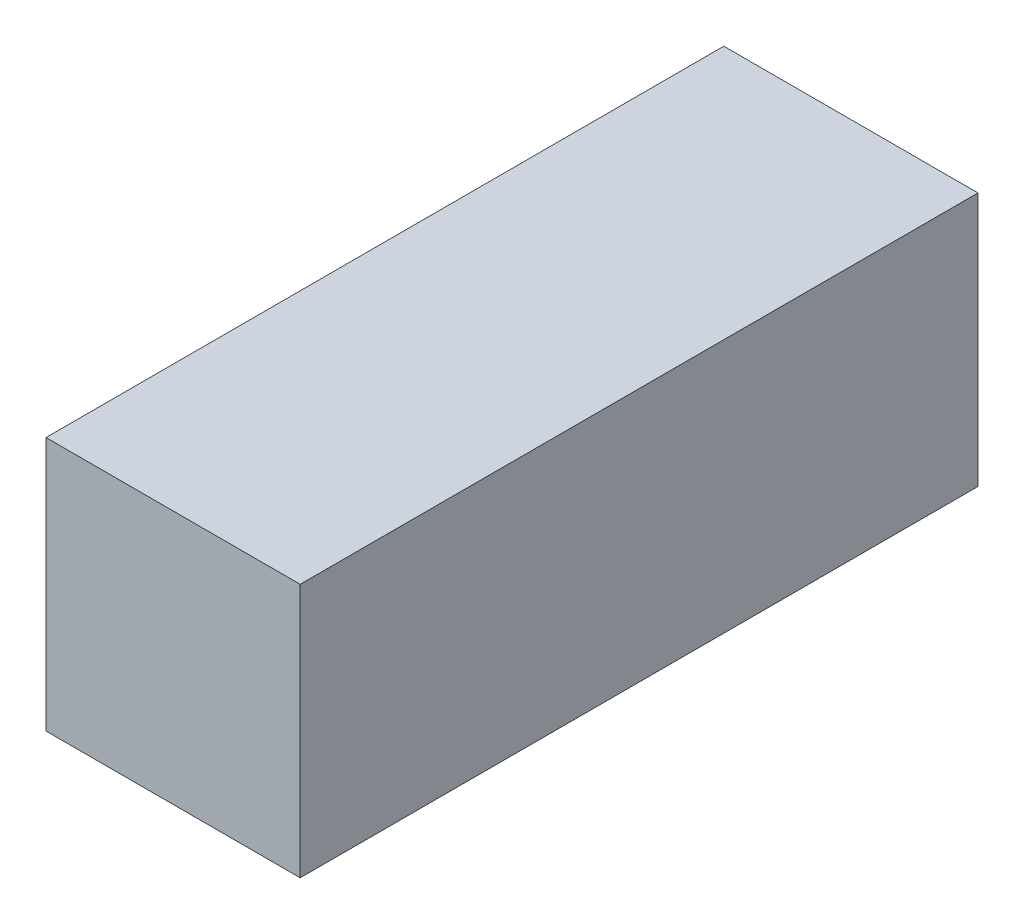
ISO-10303-21;
HEADER;
FILE_DESCRIPTION(('STEP AP214'),'2;1');
FILE_NAME('part.step','',(''),(''),'','','');
FILE_SCHEMA(('AUTOMOTIVE_DESIGN { 1 0 10303 214 1 1 1 1 }'));
ENDSEC;
DATA;
#1=APPLICATION_CONTEXT('core data for automotive mechanical design processes');
#2=APPLICATION_PROTOCOL_DEFINITION('international standard','automotive_design',2000,#1);
#3=PRODUCT_CONTEXT('',#1,'mechanical');
#4=PRODUCT('Part','Part','',(#3));
#5=PRODUCT_RELATED_PRODUCT_CATEGORY('part','',(#4));
#6=PRODUCT_DEFINITION_FORMATION('','',#4);
#7=PRODUCT_DEFINITION_CONTEXT('part definition',#1,'design');
#8=PRODUCT_DEFINITION('design','',#6,#7);
#9=PRODUCT_DEFINITION_SHAPE('','',#8);
#10=(LENGTH_UNIT() NAMED_UNIT(*) SI_UNIT(.MILLI.,.METRE.));
#11=(NAMED_UNIT(*) PLANE_ANGLE_UNIT() SI_UNIT($,.RADIAN.));
#12=(NAMED_UNIT(*) SI_UNIT($,.STERADIAN.) SOLID_ANGLE_UNIT());
#13=UNCERTAINTY_MEASURE_WITH_UNIT(LENGTH_MEASURE(1.E-05),#10,'distance_accuracy_value','');
#14=(GEOMETRIC_REPRESENTATION_CONTEXT(3) GLOBAL_UNCERTAINTY_ASSIGNED_CONTEXT((#13)) GLOBAL_UNIT_ASSIGNED_CONTEXT((#10,
#11,#12)) REPRESENTATION_CONTEXT('',''));
#15=CARTESIAN_POINT('',(0.,0.,0.));
#16=DIRECTION('',(0.,0.,1.));
#17=DIRECTION('',(1.,0.,0.));
#18=AXIS2_PLACEMENT_3D('',#15,#16,#17);
#19=CARTESIAN_POINT('',(7.5,-7.5,20.));
#20=DIRECTION('',(-1.,0.,0.));
#21=DIRECTION('',(0.,0.,1.));
#22=AXIS2_PLACEMENT_3D('',#19,#20,#21);
#23=PLANE('',#22);
#24=DIRECTION('',(0.,1.,0.));
#25=VECTOR('',#24,1.);
#26=CARTESIAN_POINT('',(7.5,-7.5,-20.));
#27=LINE('',#26,#25);
#28=CARTESIAN_POINT('',(7.5,-7.5,-20.));
#29=VERTEX_POINT('',#28);
#30=CARTESIAN_POINT('',(7.5,7.5,-20.));
#31=VERTEX_POINT('',#30);
#32=EDGE_CURVE('E103',#29,#31,#27,.T.);
#33=ORIENTED_EDGE('',*,*,#32,.T.);
#34=DIRECTION('',(0.,0.,-1.));
#35=VECTOR('',#34,1.);
#36=CARTESIAN_POINT('',(7.5,7.5,20.));
#37=LINE('',#36,#35);
#38=CARTESIAN_POINT('',(7.5,7.5,20.));
#39=VERTEX_POINT('',#38);
#40=EDGE_CURVE('E11',#39,#31,#37,.T.);
#41=ORIENTED_EDGE('',*,*,#40,.F.);
#42=DIRECTION('',(0.,1.,0.));
#43=VECTOR('',#42,1.);
#44=CARTESIAN_POINT('',(7.5,-7.5,20.));
#45=LINE('',#44,#43);
#46=CARTESIAN_POINT('',(7.5,-7.5,20.));
#47=VERTEX_POINT('',#46);
#48=EDGE_CURVE('E91',#47,#39,#45,.T.);
#49=ORIENTED_EDGE('',*,*,#48,.F.);
#50=DIRECTION('',(0.,0.,-1.));
#51=VECTOR('',#50,1.);
#52=CARTESIAN_POINT('',(7.5,-7.5,20.));
#53=LINE('',#52,#51);
#54=EDGE_CURVE('E99',#47,#29,#53,.T.);
#55=ORIENTED_EDGE('',*,*,#54,.T.);
#56=EDGE_LOOP('',(#33,#41,#49,#55));
#57=FACE_BOUND('',#56,.T.);
#58=ADVANCED_FACE('F40',(#57),#23,.F.);
#59=CARTESIAN_POINT('',(-7.5,7.5,20.));
#60=DIRECTION('',(0.,-1.,0.));
#61=DIRECTION('',(0.,0.,-1.));
#62=AXIS2_PLACEMENT_3D('',#59,#60,#61);
#63=PLANE('',#62);
#64=DIRECTION('',(-1.,0.,0.));
#65=VECTOR('',#64,1.);
#66=CARTESIAN_POINT('',(-7.5,7.5,-20.));
#67=LINE('',#66,#65);
#68=CARTESIAN_POINT('',(-7.5,7.5,-20.));
#69=VERTEX_POINT('',#68);
#70=EDGE_CURVE('E95',#31,#69,#67,.T.);
#71=ORIENTED_EDGE('',*,*,#70,.T.);
#72=DIRECTION('',(0.,0.,-1.));
#73=VECTOR('',#72,1.);
#74=CARTESIAN_POINT('',(-7.5,7.5,20.));
#75=LINE('',#74,#73);
#76=CARTESIAN_POINT('',(-7.5,7.5,20.));
#77=VERTEX_POINT('',#76);
#78=EDGE_CURVE('E48',#77,#69,#75,.T.);
#79=ORIENTED_EDGE('',*,*,#78,.F.);
#80=DIRECTION('',(-1.,0.,0.));
#81=VECTOR('',#80,1.);
#82=CARTESIAN_POINT('',(-7.5,7.5,20.));
#83=LINE('',#82,#81);
#84=EDGE_CURVE('E86',#39,#77,#83,.T.);
#85=ORIENTED_EDGE('',*,*,#84,.F.);
#86=ORIENTED_EDGE('',*,*,#40,.T.);
#87=EDGE_LOOP('',(#71,#79,#85,#86));
#88=FACE_BOUND('',#87,.T.);
#89=ADVANCED_FACE('F94',(#88),#63,.F.);
#90=CARTESIAN_POINT('',(-7.5,-7.5,20.));
#91=DIRECTION('',(1.,0.,0.));
#92=DIRECTION('',(0.,0.,-1.));
#93=AXIS2_PLACEMENT_3D('',#90,#91,#92);
#94=PLANE('',#93);
#95=DIRECTION('',(0.,-1.,0.));
#96=VECTOR('',#95,1.);
#97=CARTESIAN_POINT('',(-7.5,-7.5,-20.));
#98=LINE('',#97,#96);
#99=CARTESIAN_POINT('',(-7.5,-7.5,-20.));
#100=VERTEX_POINT('',#99);
#101=EDGE_CURVE('E73',#69,#100,#98,.T.);
#102=ORIENTED_EDGE('',*,*,#101,.T.);
#103=DIRECTION('',(0.,0.,-1.));
#104=VECTOR('',#103,1.);
#105=CARTESIAN_POINT('',(-7.5,-7.5,20.));
#106=LINE('',#105,#104);
#107=CARTESIAN_POINT('',(-7.5,-7.5,20.));
#108=VERTEX_POINT('',#107);
#109=EDGE_CURVE('E96',#108,#100,#106,.T.);
#110=ORIENTED_EDGE('',*,*,#109,.F.);
#111=DIRECTION('',(0.,-1.,0.));
#112=VECTOR('',#111,1.);
#113=CARTESIAN_POINT('',(-7.5,-7.5,20.));
#114=LINE('',#113,#112);
#115=EDGE_CURVE('E89',#77,#108,#114,.T.);
#116=ORIENTED_EDGE('',*,*,#115,.F.);
#117=ORIENTED_EDGE('',*,*,#78,.T.);
#118=EDGE_LOOP('',(#102,#110,#116,#117));
#119=FACE_BOUND('',#118,.T.);
#120=ADVANCED_FACE('F97',(#119),#94,.F.);
#121=CARTESIAN_POINT('',(-7.5,-7.5,20.));
#122=DIRECTION('',(0.,1.,0.));
#123=DIRECTION('',(0.,0.,1.));
#124=AXIS2_PLACEMENT_3D('',#121,#122,#123);
#125=PLANE('',#124);
#126=DIRECTION('',(1.,0.,0.));
#127=VECTOR('',#126,1.);
#128=CARTESIAN_POINT('',(-7.5,-7.5,-20.));
#129=LINE('',#128,#127);
#130=EDGE_CURVE('E79',#100,#29,#129,.T.);
#131=ORIENTED_EDGE('',*,*,#130,.T.);
#132=ORIENTED_EDGE('',*,*,#54,.F.);
#133=DIRECTION('',(1.,0.,0.));
#134=VECTOR('',#133,1.);
#135=CARTESIAN_POINT('',(-7.5,-7.5,20.));
#136=LINE('',#135,#134);
#137=EDGE_CURVE('E56',#108,#47,#136,.T.);
#138=ORIENTED_EDGE('',*,*,#137,.F.);
#139=ORIENTED_EDGE('',*,*,#109,.T.);
#140=EDGE_LOOP('',(#131,#132,#138,#139));
#141=FACE_BOUND('',#140,.T.);
#142=ADVANCED_FACE('F111',(#141),#125,.F.);
#143=CARTESIAN_POINT('',(0.,0.,20.));
#144=DIRECTION('',(0.,0.,-1.));
#145=DIRECTION('',(-1.,0.,0.));
#146=AXIS2_PLACEMENT_3D('',#143,#144,#145);
#147=PLANE('',#146);
#148=ORIENTED_EDGE('',*,*,#48,.T.);
#149=ORIENTED_EDGE('',*,*,#84,.T.);
#150=ORIENTED_EDGE('',*,*,#115,.T.);
#151=ORIENTED_EDGE('',*,*,#137,.T.);
#152=EDGE_LOOP('',(#148,#149,#150,#151));
#153=FACE_BOUND('',#152,.T.);
#154=ADVANCED_FACE('F87',(#153),#147,.F.);
#155=CARTESIAN_POINT('',(0.,0.,-20.));
#156=DIRECTION('',(0.,0.,-1.));
#157=DIRECTION('',(-1.,0.,0.));
#158=AXIS2_PLACEMENT_3D('',#155,#156,#157);
#159=PLANE('',#158);
#160=ORIENTED_EDGE('',*,*,#32,.F.);
#161=ORIENTED_EDGE('',*,*,#130,.F.);
#162=ORIENTED_EDGE('',*,*,#101,.F.);
#163=ORIENTED_EDGE('',*,*,#70,.F.);
#164=EDGE_LOOP('',(#160,#161,#162,#163));
#165=FACE_BOUND('',#164,.T.);
#166=ADVANCED_FACE('F114',(#165),#159,.T.);
#167=CLOSED_SHELL('',(#58,#89,#120,#142,#154,#166));
#168=CARTESIAN_POINT('',(0.,0.,-17.5));
#169=DIRECTION('',(0.,0.,1.));
#170=DIRECTION('',(1.,0.,0.));
#171=AXIS2_PLACEMENT_3D('',#168,#169,#170);
#172=CYLINDRICAL_SURFACE('',#171,5.);
#173=CARTESIAN_POINT('',(0.,0.,-17.5));
#174=DIRECTION('',(0.,0.,1.));
#175=DIRECTION('',(1.,0.,0.));
#176=AXIS2_PLACEMENT_3D('',#173,#174,#175);
#177=CIRCLE('',#176,5.);
#178=CARTESIAN_POINT('',(5.,0.,-17.5));
#179=VERTEX_POINT('',#178);
#180=EDGE_CURVE('E106',#179,#179,#177,.T.);
#181=ORIENTED_EDGE('',*,*,#180,.F.);
#182=EDGE_LOOP('',(#181));
#183=FACE_BOUND('',#182,.T.);
#184=CARTESIAN_POINT('',(0.,0.,17.5));
#185=DIRECTION('',(0.,0.,1.));
#186=DIRECTION('',(1.,0.,0.));
#187=AXIS2_PLACEMENT_3D('',#184,#185,#186);
#188=CIRCLE('',#187,5.);
#189=CARTESIAN_POINT('',(5.,0.,17.5));
#190=VERTEX_POINT('',#189);
#191=EDGE_CURVE('E117',#190,#190,#188,.T.);
#192=ORIENTED_EDGE('',*,*,#191,.T.);
#193=EDGE_LOOP('',(#192));
#194=FACE_BOUND('',#193,.T.);
#195=ADVANCED_FACE('F125',(#183,#194),#172,.F.);
#196=CARTESIAN_POINT('',(0.,0.,-17.5));
#197=DIRECTION('',(0.,0.,1.));
#198=DIRECTION('',(1.,0.,0.));
#199=AXIS2_PLACEMENT_3D('',#196,#197,#198);
#200=PLANE('',#199);
#201=ORIENTED_EDGE('',*,*,#180,.T.);
#202=EDGE_LOOP('',(#201));
#203=FACE_BOUND('',#202,.T.);
#204=ADVANCED_FACE('F123',(#203),#200,.T.);
#205=CARTESIAN_POINT('',(0.,0.,17.5));
#206=DIRECTION('',(0.,0.,1.));
#207=DIRECTION('',(1.,0.,0.));
#208=AXIS2_PLACEMENT_3D('',#205,#206,#207);
#209=PLANE('',#208);
#210=ORIENTED_EDGE('',*,*,#191,.F.);
#211=EDGE_LOOP('',(#210));
#212=FACE_BOUND('',#211,.T.);
#213=ADVANCED_FACE('F132',(#212),#209,.F.);
#214=CLOSED_SHELL('',(#195,#204,#213));
#215=ORIENTED_CLOSED_SHELL('',*,#214,.T.);
#216=BREP_WITH_VOIDS('B2',#167,(#215));
#217=ADVANCED_BREP_SHAPE_REPRESENTATION('',(#18,#216),#14);
#218=SHAPE_DEFINITION_REPRESENTATION(#9,#217);
ENDSEC;
END-ISO-10303-21;
